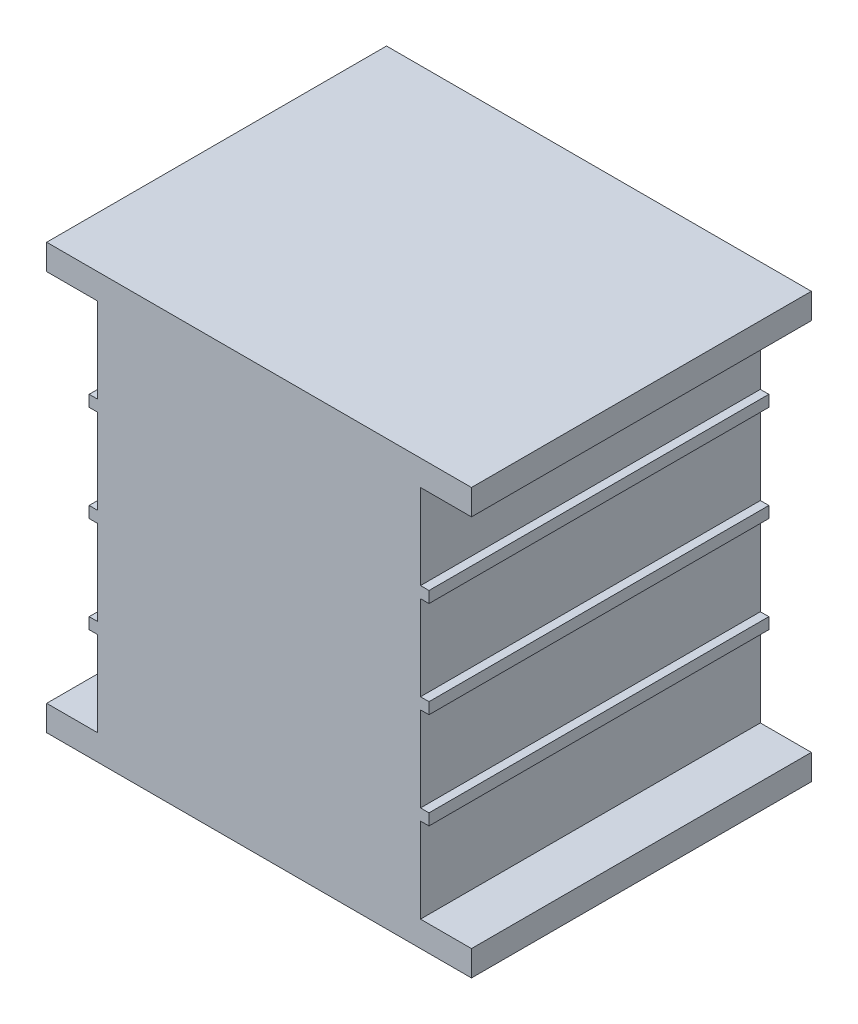
ISO-10303-21;
HEADER;
FILE_DESCRIPTION(('STEP AP214'),'2;1');
FILE_NAME('part.step','',(''),(''),'','','');
FILE_SCHEMA(('AUTOMOTIVE_DESIGN { 1 0 10303 214 1 1 1 1 }'));
ENDSEC;
DATA;
#1=APPLICATION_CONTEXT('core data for automotive mechanical design processes');
#2=APPLICATION_PROTOCOL_DEFINITION('international standard','automotive_design',2000,#1);
#3=PRODUCT_CONTEXT('',#1,'mechanical');
#4=PRODUCT('Part','Part','',(#3));
#5=PRODUCT_RELATED_PRODUCT_CATEGORY('part','',(#4));
#6=PRODUCT_DEFINITION_FORMATION('','',#4);
#7=PRODUCT_DEFINITION_CONTEXT('part definition',#1,'design');
#8=PRODUCT_DEFINITION('design','',#6,#7);
#9=PRODUCT_DEFINITION_SHAPE('','',#8);
#10=(LENGTH_UNIT() NAMED_UNIT(*) SI_UNIT(.MILLI.,.METRE.));
#11=(NAMED_UNIT(*) PLANE_ANGLE_UNIT() SI_UNIT($,.RADIAN.));
#12=(NAMED_UNIT(*) SI_UNIT($,.STERADIAN.) SOLID_ANGLE_UNIT());
#13=UNCERTAINTY_MEASURE_WITH_UNIT(LENGTH_MEASURE(1.E-05),#10,'distance_accuracy_value','');
#14=(GEOMETRIC_REPRESENTATION_CONTEXT(3) GLOBAL_UNCERTAINTY_ASSIGNED_CONTEXT((#13)) GLOBAL_UNIT_ASSIGNED_CONTEXT((#10,
#11,#12)) REPRESENTATION_CONTEXT('',''));
#15=CARTESIAN_POINT('',(0.,0.,0.));
#16=DIRECTION('',(0.,0.,1.));
#17=DIRECTION('',(1.,0.,0.));
#18=AXIS2_PLACEMENT_3D('',#15,#16,#17);
#19=CARTESIAN_POINT('',(0.,1.5,20.));
#20=DIRECTION('',(1.,0.,0.));
#21=DIRECTION('',(0.,0.,-1.));
#22=AXIS2_PLACEMENT_3D('',#19,#20,#21);
#23=PLANE('',#22);
#24=DIRECTION('',(0.,-1.,0.));
#25=VECTOR('',#24,1.);
#26=CARTESIAN_POINT('',(0.,1.5,0.));
#27=LINE('',#26,#25);
#28=CARTESIAN_POINT('',(0.,1.5,0.));
#29=VERTEX_POINT('',#28);
#30=CARTESIAN_POINT('',(0.,0.,0.));
#31=VERTEX_POINT('',#30);
#32=EDGE_CURVE('E314',#29,#31,#27,.T.);
#33=ORIENTED_EDGE('',*,*,#32,.T.);
#34=DIRECTION('',(0.,0.,-1.));
#35=VECTOR('',#34,1.);
#36=CARTESIAN_POINT('',(0.,0.,20.));
#37=LINE('',#36,#35);
#38=CARTESIAN_POINT('',(0.,0.,20.));
#39=VERTEX_POINT('',#38);
#40=EDGE_CURVE('E11',#39,#31,#37,.T.);
#41=ORIENTED_EDGE('',*,*,#40,.F.);
#42=DIRECTION('',(0.,-1.,0.));
#43=VECTOR('',#42,1.);
#44=CARTESIAN_POINT('',(0.,1.5,20.));
#45=LINE('',#44,#43);
#46=CARTESIAN_POINT('',(0.,1.5,20.));
#47=VERTEX_POINT('',#46);
#48=EDGE_CURVE('E420',#47,#39,#45,.T.);
#49=ORIENTED_EDGE('',*,*,#48,.F.);
#50=DIRECTION('',(0.,0.,-1.));
#51=VECTOR('',#50,1.);
#52=CARTESIAN_POINT('',(0.,1.5,20.));
#53=LINE('',#52,#51);
#54=EDGE_CURVE('E310',#47,#29,#53,.T.);
#55=ORIENTED_EDGE('',*,*,#54,.T.);
#56=EDGE_LOOP('',(#33,#41,#49,#55));
#57=FACE_BOUND('',#56,.T.);
#58=ADVANCED_FACE('F45',(#57),#23,.F.);
#59=CARTESIAN_POINT('',(0.,0.,20.));
#60=DIRECTION('',(0.,1.,0.));
#61=DIRECTION('',(0.,0.,1.));
#62=AXIS2_PLACEMENT_3D('',#59,#60,#61);
#63=PLANE('',#62);
#64=DIRECTION('',(1.,0.,0.));
#65=VECTOR('',#64,1.);
#66=CARTESIAN_POINT('',(0.,0.,0.));
#67=LINE('',#66,#65);
#68=CARTESIAN_POINT('',(25.,0.,0.));
#69=VERTEX_POINT('',#68);
#70=EDGE_CURVE('E318',#31,#69,#67,.T.);
#71=ORIENTED_EDGE('',*,*,#70,.T.);
#72=DIRECTION('',(0.,0.,-1.));
#73=VECTOR('',#72,1.);
#74=CARTESIAN_POINT('',(25.,0.,20.));
#75=LINE('',#74,#73);
#76=CARTESIAN_POINT('',(25.,0.,20.));
#77=VERTEX_POINT('',#76);
#78=EDGE_CURVE('E54',#77,#69,#75,.T.);
#79=ORIENTED_EDGE('',*,*,#78,.F.);
#80=DIRECTION('',(1.,0.,0.));
#81=VECTOR('',#80,1.);
#82=CARTESIAN_POINT('',(0.,0.,20.));
#83=LINE('',#82,#81);
#84=EDGE_CURVE('E189',#39,#77,#83,.T.);
#85=ORIENTED_EDGE('',*,*,#84,.F.);
#86=ORIENTED_EDGE('',*,*,#40,.T.);
#87=EDGE_LOOP('',(#71,#79,#85,#86));
#88=FACE_BOUND('',#87,.T.);
#89=ADVANCED_FACE('F682',(#88),#63,.F.);
#90=CARTESIAN_POINT('',(25.,0.,20.));
#91=DIRECTION('',(-1.,0.,0.));
#92=DIRECTION('',(0.,0.,1.));
#93=AXIS2_PLACEMENT_3D('',#90,#91,#92);
#94=PLANE('',#93);
#95=DIRECTION('',(0.,1.,0.));
#96=VECTOR('',#95,1.);
#97=CARTESIAN_POINT('',(25.,0.,0.));
#98=LINE('',#97,#96);
#99=CARTESIAN_POINT('',(25.,1.5,0.));
#100=VERTEX_POINT('',#99);
#101=EDGE_CURVE('E321',#69,#100,#98,.T.);
#102=ORIENTED_EDGE('',*,*,#101,.T.);
#103=DIRECTION('',(0.,0.,-1.));
#104=VECTOR('',#103,1.);
#105=CARTESIAN_POINT('',(25.,1.5,20.));
#106=LINE('',#105,#104);
#107=CARTESIAN_POINT('',(25.,1.5,20.));
#108=VERTEX_POINT('',#107);
#109=EDGE_CURVE('E543',#108,#100,#106,.T.);
#110=ORIENTED_EDGE('',*,*,#109,.F.);
#111=DIRECTION('',(0.,1.,0.));
#112=VECTOR('',#111,1.);
#113=CARTESIAN_POINT('',(25.,0.,20.));
#114=LINE('',#113,#112);
#115=EDGE_CURVE('E553',#77,#108,#114,.T.);
#116=ORIENTED_EDGE('',*,*,#115,.F.);
#117=ORIENTED_EDGE('',*,*,#78,.T.);
#118=EDGE_LOOP('',(#102,#110,#116,#117));
#119=FACE_BOUND('',#118,.T.);
#120=ADVANCED_FACE('F551',(#119),#94,.F.);
#121=CARTESIAN_POINT('',(25.,1.5,20.));
#122=DIRECTION('',(0.,-1.,0.));
#123=DIRECTION('',(1.,0.,0.));
#124=AXIS2_PLACEMENT_3D('',#121,#122,#123);
#125=PLANE('',#124);
#126=DIRECTION('',(-1.,0.,0.));
#127=VECTOR('',#126,1.);
#128=CARTESIAN_POINT('',(25.,1.5,0.));
#129=LINE('',#128,#127);
#130=CARTESIAN_POINT('',(22.,1.5,0.));
#131=VERTEX_POINT('',#130);
#132=EDGE_CURVE('E324',#100,#131,#129,.T.);
#133=ORIENTED_EDGE('',*,*,#132,.T.);
#134=DIRECTION('',(0.,0.,-1.));
#135=VECTOR('',#134,1.);
#136=CARTESIAN_POINT('',(22.,1.5,20.));
#137=LINE('',#136,#135);
#138=CARTESIAN_POINT('',(22.,1.5,20.));
#139=VERTEX_POINT('',#138);
#140=EDGE_CURVE('E539',#139,#131,#137,.T.);
#141=ORIENTED_EDGE('',*,*,#140,.F.);
#142=DIRECTION('',(-1.,0.,0.));
#143=VECTOR('',#142,1.);
#144=CARTESIAN_POINT('',(25.,1.5,20.));
#145=LINE('',#144,#143);
#146=EDGE_CURVE('E572',#108,#139,#145,.T.);
#147=ORIENTED_EDGE('',*,*,#146,.F.);
#148=ORIENTED_EDGE('',*,*,#109,.T.);
#149=EDGE_LOOP('',(#133,#141,#147,#148));
#150=FACE_BOUND('',#149,.T.);
#151=ADVANCED_FACE('F562',(#150),#125,.F.);
#152=CARTESIAN_POINT('',(22.,1.5,20.));
#153=DIRECTION('',(-1.,0.,0.));
#154=DIRECTION('',(0.,0.,1.));
#155=AXIS2_PLACEMENT_3D('',#152,#153,#154);
#156=PLANE('',#155);
#157=DIRECTION('',(0.,1.,0.));
#158=VECTOR('',#157,1.);
#159=CARTESIAN_POINT('',(22.,1.5,0.));
#160=LINE('',#159,#158);
#161=CARTESIAN_POINT('',(22.,6.5,0.));
#162=VERTEX_POINT('',#161);
#163=EDGE_CURVE('E327',#131,#162,#160,.T.);
#164=ORIENTED_EDGE('',*,*,#163,.T.);
#165=DIRECTION('',(0.,0.,-1.));
#166=VECTOR('',#165,1.);
#167=CARTESIAN_POINT('',(22.,6.5,20.));
#168=LINE('',#167,#166);
#169=CARTESIAN_POINT('',(22.,6.5,20.));
#170=VERTEX_POINT('',#169);
#171=EDGE_CURVE('E535',#170,#162,#168,.T.);
#172=ORIENTED_EDGE('',*,*,#171,.F.);
#173=DIRECTION('',(0.,1.,0.));
#174=VECTOR('',#173,1.);
#175=CARTESIAN_POINT('',(22.,1.5,20.));
#176=LINE('',#175,#174);
#177=EDGE_CURVE('E568',#139,#170,#176,.T.);
#178=ORIENTED_EDGE('',*,*,#177,.F.);
#179=ORIENTED_EDGE('',*,*,#140,.T.);
#180=EDGE_LOOP('',(#164,#172,#178,#179));
#181=FACE_BOUND('',#180,.T.);
#182=ADVANCED_FACE('F566',(#181),#156,.F.);
#183=CARTESIAN_POINT('',(22.,6.5,20.));
#184=DIRECTION('',(0.,1.,0.));
#185=DIRECTION('',(-1.,0.,0.));
#186=AXIS2_PLACEMENT_3D('',#183,#184,#185);
#187=PLANE('',#186);
#188=DIRECTION('',(1.,0.,0.));
#189=VECTOR('',#188,1.);
#190=CARTESIAN_POINT('',(22.,6.5,0.));
#191=LINE('',#190,#189);
#192=CARTESIAN_POINT('',(22.5,6.5,0.));
#193=VERTEX_POINT('',#192);
#194=EDGE_CURVE('E330',#162,#193,#191,.T.);
#195=ORIENTED_EDGE('',*,*,#194,.T.);
#196=DIRECTION('',(0.,0.,-1.));
#197=VECTOR('',#196,1.);
#198=CARTESIAN_POINT('',(22.5,6.5,20.));
#199=LINE('',#198,#197);
#200=CARTESIAN_POINT('',(22.5,6.5,20.));
#201=VERTEX_POINT('',#200);
#202=EDGE_CURVE('E531',#201,#193,#199,.T.);
#203=ORIENTED_EDGE('',*,*,#202,.F.);
#204=DIRECTION('',(1.,0.,0.));
#205=VECTOR('',#204,1.);
#206=CARTESIAN_POINT('',(22.,6.5,20.));
#207=LINE('',#206,#205);
#208=EDGE_CURVE('E571',#170,#201,#207,.T.);
#209=ORIENTED_EDGE('',*,*,#208,.F.);
#210=ORIENTED_EDGE('',*,*,#171,.T.);
#211=EDGE_LOOP('',(#195,#203,#209,#210));
#212=FACE_BOUND('',#211,.T.);
#213=ADVANCED_FACE('F695',(#212),#187,.F.);
#214=CARTESIAN_POINT('',(22.5,6.5,20.));
#215=DIRECTION('',(-1.,0.,0.));
#216=DIRECTION('',(0.,0.,1.));
#217=AXIS2_PLACEMENT_3D('',#214,#215,#216);
#218=PLANE('',#217);
#219=DIRECTION('',(0.,1.,0.));
#220=VECTOR('',#219,1.);
#221=CARTESIAN_POINT('',(22.5,6.5,0.));
#222=LINE('',#221,#220);
#223=CARTESIAN_POINT('',(22.5,7.16666666666667,0.));
#224=VERTEX_POINT('',#223);
#225=EDGE_CURVE('E333',#193,#224,#222,.T.);
#226=ORIENTED_EDGE('',*,*,#225,.T.);
#227=DIRECTION('',(0.,0.,-1.));
#228=VECTOR('',#227,1.);
#229=CARTESIAN_POINT('',(22.5,7.16666666666667,20.));
#230=LINE('',#229,#228);
#231=CARTESIAN_POINT('',(22.5,7.16666666666667,20.));
#232=VERTEX_POINT('',#231);
#233=EDGE_CURVE('E527',#232,#224,#230,.T.);
#234=ORIENTED_EDGE('',*,*,#233,.F.);
#235=DIRECTION('',(0.,1.,0.));
#236=VECTOR('',#235,1.);
#237=CARTESIAN_POINT('',(22.5,6.5,20.));
#238=LINE('',#237,#236);
#239=EDGE_CURVE('E576',#201,#232,#238,.T.);
#240=ORIENTED_EDGE('',*,*,#239,.F.);
#241=ORIENTED_EDGE('',*,*,#202,.T.);
#242=EDGE_LOOP('',(#226,#234,#240,#241));
#243=FACE_BOUND('',#242,.T.);
#244=ADVANCED_FACE('F698',(#243),#218,.F.);
#245=CARTESIAN_POINT('',(22.5,7.16666666666667,20.));
#246=DIRECTION('',(0.,-1.,0.));
#247=DIRECTION('',(0.,0.,-1.));
#248=AXIS2_PLACEMENT_3D('',#245,#246,#247);
#249=PLANE('',#248);
#250=DIRECTION('',(-1.,0.,0.));
#251=VECTOR('',#250,1.);
#252=CARTESIAN_POINT('',(22.5,7.16666666666667,0.));
#253=LINE('',#252,#251);
#254=CARTESIAN_POINT('',(22.,7.16666666666667,0.));
#255=VERTEX_POINT('',#254);
#256=EDGE_CURVE('E336',#224,#255,#253,.T.);
#257=ORIENTED_EDGE('',*,*,#256,.T.);
#258=DIRECTION('',(0.,0.,-1.));
#259=VECTOR('',#258,1.);
#260=CARTESIAN_POINT('',(22.,7.16666666666667,20.));
#261=LINE('',#260,#259);
#262=CARTESIAN_POINT('',(22.,7.16666666666667,20.));
#263=VERTEX_POINT('',#262);
#264=EDGE_CURVE('E523',#263,#255,#261,.T.);
#265=ORIENTED_EDGE('',*,*,#264,.F.);
#266=DIRECTION('',(-1.,0.,0.));
#267=VECTOR('',#266,1.);
#268=CARTESIAN_POINT('',(22.5,7.16666666666667,20.));
#269=LINE('',#268,#267);
#270=EDGE_CURVE('E583',#232,#263,#269,.T.);
#271=ORIENTED_EDGE('',*,*,#270,.F.);
#272=ORIENTED_EDGE('',*,*,#233,.T.);
#273=EDGE_LOOP('',(#257,#265,#271,#272));
#274=FACE_BOUND('',#273,.T.);
#275=ADVANCED_FACE('F702',(#274),#249,.F.);
#276=CARTESIAN_POINT('',(22.,7.16666666666667,20.));
#277=DIRECTION('',(-1.,0.,0.));
#278=DIRECTION('',(0.,0.,1.));
#279=AXIS2_PLACEMENT_3D('',#276,#277,#278);
#280=PLANE('',#279);
#281=DIRECTION('',(0.,1.,0.));
#282=VECTOR('',#281,1.);
#283=CARTESIAN_POINT('',(22.,7.16666666666667,0.));
#284=LINE('',#283,#282);
#285=CARTESIAN_POINT('',(22.,12.1666666666667,0.));
#286=VERTEX_POINT('',#285);
#287=EDGE_CURVE('E339',#255,#286,#284,.T.);
#288=ORIENTED_EDGE('',*,*,#287,.T.);
#289=DIRECTION('',(0.,0.,-1.));
#290=VECTOR('',#289,1.);
#291=CARTESIAN_POINT('',(22.,12.1666666666667,20.));
#292=LINE('',#291,#290);
#293=CARTESIAN_POINT('',(22.,12.1666666666667,20.));
#294=VERTEX_POINT('',#293);
#295=EDGE_CURVE('E519',#294,#286,#292,.T.);
#296=ORIENTED_EDGE('',*,*,#295,.F.);
#297=DIRECTION('',(0.,1.,0.));
#298=VECTOR('',#297,1.);
#299=CARTESIAN_POINT('',(22.,7.16666666666667,20.));
#300=LINE('',#299,#298);
#301=EDGE_CURVE('E586',#263,#294,#300,.T.);
#302=ORIENTED_EDGE('',*,*,#301,.F.);
#303=ORIENTED_EDGE('',*,*,#264,.T.);
#304=EDGE_LOOP('',(#288,#296,#302,#303));
#305=FACE_BOUND('',#304,.T.);
#306=ADVANCED_FACE('F706',(#305),#280,.F.);
#307=CARTESIAN_POINT('',(22.,12.1666666666667,20.));
#308=DIRECTION('',(0.,1.,0.));
#309=DIRECTION('',(0.,0.,1.));
#310=AXIS2_PLACEMENT_3D('',#307,#308,#309);
#311=PLANE('',#310);
#312=DIRECTION('',(1.,0.,0.));
#313=VECTOR('',#312,1.);
#314=CARTESIAN_POINT('',(22.,12.1666666666667,0.));
#315=LINE('',#314,#313);
#316=CARTESIAN_POINT('',(22.5,12.1666666666667,0.));
#317=VERTEX_POINT('',#316);
#318=EDGE_CURVE('E342',#286,#317,#315,.T.);
#319=ORIENTED_EDGE('',*,*,#318,.T.);
#320=DIRECTION('',(0.,0.,-1.));
#321=VECTOR('',#320,1.);
#322=CARTESIAN_POINT('',(22.5,12.1666666666667,20.));
#323=LINE('',#322,#321);
#324=CARTESIAN_POINT('',(22.5,12.1666666666667,20.));
#325=VERTEX_POINT('',#324);
#326=EDGE_CURVE('E515',#325,#317,#323,.T.);
#327=ORIENTED_EDGE('',*,*,#326,.F.);
#328=DIRECTION('',(1.,0.,0.));
#329=VECTOR('',#328,1.);
#330=CARTESIAN_POINT('',(22.,12.1666666666667,20.));
#331=LINE('',#330,#329);
#332=EDGE_CURVE('E589',#294,#325,#331,.T.);
#333=ORIENTED_EDGE('',*,*,#332,.F.);
#334=ORIENTED_EDGE('',*,*,#295,.T.);
#335=EDGE_LOOP('',(#319,#327,#333,#334));
#336=FACE_BOUND('',#335,.T.);
#337=ADVANCED_FACE('F710',(#336),#311,.F.);
#338=CARTESIAN_POINT('',(22.5,12.1666666666667,20.));
#339=DIRECTION('',(-1.,0.,0.));
#340=DIRECTION('',(0.,0.,1.));
#341=AXIS2_PLACEMENT_3D('',#338,#339,#340);
#342=PLANE('',#341);
#343=DIRECTION('',(0.,1.,0.));
#344=VECTOR('',#343,1.);
#345=CARTESIAN_POINT('',(22.5,12.1666666666667,0.));
#346=LINE('',#345,#344);
#347=CARTESIAN_POINT('',(22.5,12.8333333333333,0.));
#348=VERTEX_POINT('',#347);
#349=EDGE_CURVE('E345',#317,#348,#346,.T.);
#350=ORIENTED_EDGE('',*,*,#349,.T.);
#351=DIRECTION('',(0.,0.,-1.));
#352=VECTOR('',#351,1.);
#353=CARTESIAN_POINT('',(22.5,12.8333333333333,20.));
#354=LINE('',#353,#352);
#355=CARTESIAN_POINT('',(22.5,12.8333333333333,20.));
#356=VERTEX_POINT('',#355);
#357=EDGE_CURVE('E511',#356,#348,#354,.T.);
#358=ORIENTED_EDGE('',*,*,#357,.F.);
#359=DIRECTION('',(0.,1.,0.));
#360=VECTOR('',#359,1.);
#361=CARTESIAN_POINT('',(22.5,12.1666666666667,20.));
#362=LINE('',#361,#360);
#363=EDGE_CURVE('E592',#325,#356,#362,.T.);
#364=ORIENTED_EDGE('',*,*,#363,.F.);
#365=ORIENTED_EDGE('',*,*,#326,.T.);
#366=EDGE_LOOP('',(#350,#358,#364,#365));
#367=FACE_BOUND('',#366,.T.);
#368=ADVANCED_FACE('F714',(#367),#342,.F.);
#369=CARTESIAN_POINT('',(22.5,12.8333333333333,20.));
#370=DIRECTION('',(0.,-1.,0.));
#371=DIRECTION('',(0.,0.,-1.));
#372=AXIS2_PLACEMENT_3D('',#369,#370,#371);
#373=PLANE('',#372);
#374=DIRECTION('',(-1.,0.,0.));
#375=VECTOR('',#374,1.);
#376=CARTESIAN_POINT('',(22.5,12.8333333333333,0.));
#377=LINE('',#376,#375);
#378=CARTESIAN_POINT('',(22.,12.8333333333333,0.));
#379=VERTEX_POINT('',#378);
#380=EDGE_CURVE('E348',#348,#379,#377,.T.);
#381=ORIENTED_EDGE('',*,*,#380,.T.);
#382=DIRECTION('',(0.,0.,-1.));
#383=VECTOR('',#382,1.);
#384=CARTESIAN_POINT('',(22.,12.8333333333333,20.));
#385=LINE('',#384,#383);
#386=CARTESIAN_POINT('',(22.,12.8333333333333,20.));
#387=VERTEX_POINT('',#386);
#388=EDGE_CURVE('E507',#387,#379,#385,.T.);
#389=ORIENTED_EDGE('',*,*,#388,.F.);
#390=DIRECTION('',(-1.,0.,0.));
#391=VECTOR('',#390,1.);
#392=CARTESIAN_POINT('',(22.5,12.8333333333333,20.));
#393=LINE('',#392,#391);
#394=EDGE_CURVE('E595',#356,#387,#393,.T.);
#395=ORIENTED_EDGE('',*,*,#394,.F.);
#396=ORIENTED_EDGE('',*,*,#357,.T.);
#397=EDGE_LOOP('',(#381,#389,#395,#396));
#398=FACE_BOUND('',#397,.T.);
#399=ADVANCED_FACE('F718',(#398),#373,.F.);
#400=CARTESIAN_POINT('',(22.,12.8333333333333,20.));
#401=DIRECTION('',(-1.,0.,0.));
#402=DIRECTION('',(0.,0.,1.));
#403=AXIS2_PLACEMENT_3D('',#400,#401,#402);
#404=PLANE('',#403);
#405=DIRECTION('',(0.,1.,0.));
#406=VECTOR('',#405,1.);
#407=CARTESIAN_POINT('',(22.,12.8333333333333,0.));
#408=LINE('',#407,#406);
#409=CARTESIAN_POINT('',(22.,17.8333333333333,0.));
#410=VERTEX_POINT('',#409);
#411=EDGE_CURVE('E351',#379,#410,#408,.T.);
#412=ORIENTED_EDGE('',*,*,#411,.T.);
#413=DIRECTION('',(0.,0.,-1.));
#414=VECTOR('',#413,1.);
#415=CARTESIAN_POINT('',(22.,17.8333333333333,20.));
#416=LINE('',#415,#414);
#417=CARTESIAN_POINT('',(22.,17.8333333333333,20.));
#418=VERTEX_POINT('',#417);
#419=EDGE_CURVE('E503',#418,#410,#416,.T.);
#420=ORIENTED_EDGE('',*,*,#419,.F.);
#421=DIRECTION('',(0.,1.,0.));
#422=VECTOR('',#421,1.);
#423=CARTESIAN_POINT('',(22.,12.8333333333333,20.));
#424=LINE('',#423,#422);
#425=EDGE_CURVE('E598',#387,#418,#424,.T.);
#426=ORIENTED_EDGE('',*,*,#425,.F.);
#427=ORIENTED_EDGE('',*,*,#388,.T.);
#428=EDGE_LOOP('',(#412,#420,#426,#427));
#429=FACE_BOUND('',#428,.T.);
#430=ADVANCED_FACE('F722',(#429),#404,.F.);
#431=CARTESIAN_POINT('',(22.,17.8333333333333,20.));
#432=DIRECTION('',(0.,1.,0.));
#433=DIRECTION('',(0.,0.,1.));
#434=AXIS2_PLACEMENT_3D('',#431,#432,#433);
#435=PLANE('',#434);
#436=DIRECTION('',(1.,0.,0.));
#437=VECTOR('',#436,1.);
#438=CARTESIAN_POINT('',(22.,17.8333333333333,0.));
#439=LINE('',#438,#437);
#440=CARTESIAN_POINT('',(22.5,17.8333333333333,0.));
#441=VERTEX_POINT('',#440);
#442=EDGE_CURVE('E354',#410,#441,#439,.T.);
#443=ORIENTED_EDGE('',*,*,#442,.T.);
#444=DIRECTION('',(0.,0.,-1.));
#445=VECTOR('',#444,1.);
#446=CARTESIAN_POINT('',(22.5,17.8333333333333,20.));
#447=LINE('',#446,#445);
#448=CARTESIAN_POINT('',(22.5,17.8333333333333,20.));
#449=VERTEX_POINT('',#448);
#450=EDGE_CURVE('E499',#449,#441,#447,.T.);
#451=ORIENTED_EDGE('',*,*,#450,.F.);
#452=DIRECTION('',(1.,0.,0.));
#453=VECTOR('',#452,1.);
#454=CARTESIAN_POINT('',(22.,17.8333333333333,20.));
#455=LINE('',#454,#453);
#456=EDGE_CURVE('E601',#418,#449,#455,.T.);
#457=ORIENTED_EDGE('',*,*,#456,.F.);
#458=ORIENTED_EDGE('',*,*,#419,.T.);
#459=EDGE_LOOP('',(#443,#451,#457,#458));
#460=FACE_BOUND('',#459,.T.);
#461=ADVANCED_FACE('F726',(#460),#435,.F.);
#462=CARTESIAN_POINT('',(22.5,17.8333333333333,20.));
#463=DIRECTION('',(-1.,0.,0.));
#464=DIRECTION('',(0.,0.,1.));
#465=AXIS2_PLACEMENT_3D('',#462,#463,#464);
#466=PLANE('',#465);
#467=DIRECTION('',(0.,1.,0.));
#468=VECTOR('',#467,1.);
#469=CARTESIAN_POINT('',(22.5,17.8333333333333,0.));
#470=LINE('',#469,#468);
#471=CARTESIAN_POINT('',(22.5,18.5,0.));
#472=VERTEX_POINT('',#471);
#473=EDGE_CURVE('E357',#441,#472,#470,.T.);
#474=ORIENTED_EDGE('',*,*,#473,.T.);
#475=DIRECTION('',(0.,0.,-1.));
#476=VECTOR('',#475,1.);
#477=CARTESIAN_POINT('',(22.5,18.5,20.));
#478=LINE('',#477,#476);
#479=CARTESIAN_POINT('',(22.5,18.5,20.));
#480=VERTEX_POINT('',#479);
#481=EDGE_CURVE('E495',#480,#472,#478,.T.);
#482=ORIENTED_EDGE('',*,*,#481,.F.);
#483=DIRECTION('',(0.,1.,0.));
#484=VECTOR('',#483,1.);
#485=CARTESIAN_POINT('',(22.5,17.8333333333333,20.));
#486=LINE('',#485,#484);
#487=EDGE_CURVE('E604',#449,#480,#486,.T.);
#488=ORIENTED_EDGE('',*,*,#487,.F.);
#489=ORIENTED_EDGE('',*,*,#450,.T.);
#490=EDGE_LOOP('',(#474,#482,#488,#489));
#491=FACE_BOUND('',#490,.T.);
#492=ADVANCED_FACE('F730',(#491),#466,.F.);
#493=CARTESIAN_POINT('',(22.5,18.5,20.));
#494=DIRECTION('',(0.,-1.,0.));
#495=DIRECTION('',(0.,0.,-1.));
#496=AXIS2_PLACEMENT_3D('',#493,#494,#495);
#497=PLANE('',#496);
#498=DIRECTION('',(-1.,0.,0.));
#499=VECTOR('',#498,1.);
#500=CARTESIAN_POINT('',(22.5,18.5,0.));
#501=LINE('',#500,#499);
#502=CARTESIAN_POINT('',(22.,18.5,0.));
#503=VERTEX_POINT('',#502);
#504=EDGE_CURVE('E360',#472,#503,#501,.T.);
#505=ORIENTED_EDGE('',*,*,#504,.T.);
#506=DIRECTION('',(0.,0.,-1.));
#507=VECTOR('',#506,1.);
#508=CARTESIAN_POINT('',(22.,18.5,20.));
#509=LINE('',#508,#507);
#510=CARTESIAN_POINT('',(22.,18.5,20.));
#511=VERTEX_POINT('',#510);
#512=EDGE_CURVE('E491',#511,#503,#509,.T.);
#513=ORIENTED_EDGE('',*,*,#512,.F.);
#514=DIRECTION('',(-1.,0.,0.));
#515=VECTOR('',#514,1.);
#516=CARTESIAN_POINT('',(22.5,18.5,20.));
#517=LINE('',#516,#515);
#518=EDGE_CURVE('E607',#480,#511,#517,.T.);
#519=ORIENTED_EDGE('',*,*,#518,.F.);
#520=ORIENTED_EDGE('',*,*,#481,.T.);
#521=EDGE_LOOP('',(#505,#513,#519,#520));
#522=FACE_BOUND('',#521,.T.);
#523=ADVANCED_FACE('F734',(#522),#497,.F.);
#524=CARTESIAN_POINT('',(22.,18.5,20.));
#525=DIRECTION('',(-1.,0.,0.));
#526=DIRECTION('',(0.,-1.,0.));
#527=AXIS2_PLACEMENT_3D('',#524,#525,#526);
#528=PLANE('',#527);
#529=DIRECTION('',(0.,1.,0.));
#530=VECTOR('',#529,1.);
#531=CARTESIAN_POINT('',(22.,18.5,0.));
#532=LINE('',#531,#530);
#533=CARTESIAN_POINT('',(22.,23.5,0.));
#534=VERTEX_POINT('',#533);
#535=EDGE_CURVE('E363',#503,#534,#532,.T.);
#536=ORIENTED_EDGE('',*,*,#535,.T.);
#537=DIRECTION('',(0.,0.,-1.));
#538=VECTOR('',#537,1.);
#539=CARTESIAN_POINT('',(22.,23.5,20.));
#540=LINE('',#539,#538);
#541=CARTESIAN_POINT('',(22.,23.5,20.));
#542=VERTEX_POINT('',#541);
#543=EDGE_CURVE('E487',#542,#534,#540,.T.);
#544=ORIENTED_EDGE('',*,*,#543,.F.);
#545=DIRECTION('',(0.,1.,0.));
#546=VECTOR('',#545,1.);
#547=CARTESIAN_POINT('',(22.,18.5,20.));
#548=LINE('',#547,#546);
#549=EDGE_CURVE('E610',#511,#542,#548,.T.);
#550=ORIENTED_EDGE('',*,*,#549,.F.);
#551=ORIENTED_EDGE('',*,*,#512,.T.);
#552=EDGE_LOOP('',(#536,#544,#550,#551));
#553=FACE_BOUND('',#552,.T.);
#554=ADVANCED_FACE('F738',(#553),#528,.F.);
#555=CARTESIAN_POINT('',(22.,23.5,20.));
#556=DIRECTION('',(0.,1.,0.));
#557=DIRECTION('',(0.,0.,1.));
#558=AXIS2_PLACEMENT_3D('',#555,#556,#557);
#559=PLANE('',#558);
#560=DIRECTION('',(1.,0.,0.));
#561=VECTOR('',#560,1.);
#562=CARTESIAN_POINT('',(22.,23.5,0.));
#563=LINE('',#562,#561);
#564=CARTESIAN_POINT('',(25.,23.5,0.));
#565=VERTEX_POINT('',#564);
#566=EDGE_CURVE('E366',#534,#565,#563,.T.);
#567=ORIENTED_EDGE('',*,*,#566,.T.);
#568=DIRECTION('',(0.,0.,-1.));
#569=VECTOR('',#568,1.);
#570=CARTESIAN_POINT('',(25.,23.5,20.));
#571=LINE('',#570,#569);
#572=CARTESIAN_POINT('',(25.,23.5,20.));
#573=VERTEX_POINT('',#572);
#574=EDGE_CURVE('E483',#573,#565,#571,.T.);
#575=ORIENTED_EDGE('',*,*,#574,.F.);
#576=DIRECTION('',(1.,0.,0.));
#577=VECTOR('',#576,1.);
#578=CARTESIAN_POINT('',(22.,23.5,20.));
#579=LINE('',#578,#577);
#580=EDGE_CURVE('E613',#542,#573,#579,.T.);
#581=ORIENTED_EDGE('',*,*,#580,.F.);
#582=ORIENTED_EDGE('',*,*,#543,.T.);
#583=EDGE_LOOP('',(#567,#575,#581,#582));
#584=FACE_BOUND('',#583,.T.);
#585=ADVANCED_FACE('F742',(#584),#559,.F.);
#586=CARTESIAN_POINT('',(25.,23.5,20.));
#587=DIRECTION('',(-1.,0.,0.));
#588=DIRECTION('',(0.,0.,1.));
#589=AXIS2_PLACEMENT_3D('',#586,#587,#588);
#590=PLANE('',#589);
#591=DIRECTION('',(0.,1.,0.));
#592=VECTOR('',#591,1.);
#593=CARTESIAN_POINT('',(25.,23.5,0.));
#594=LINE('',#593,#592);
#595=CARTESIAN_POINT('',(25.,25.,0.));
#596=VERTEX_POINT('',#595);
#597=EDGE_CURVE('E369',#565,#596,#594,.T.);
#598=ORIENTED_EDGE('',*,*,#597,.T.);
#599=DIRECTION('',(0.,0.,-1.));
#600=VECTOR('',#599,1.);
#601=CARTESIAN_POINT('',(25.,25.,20.));
#602=LINE('',#601,#600);
#603=CARTESIAN_POINT('',(25.,25.,20.));
#604=VERTEX_POINT('',#603);
#605=EDGE_CURVE('E479',#604,#596,#602,.T.);
#606=ORIENTED_EDGE('',*,*,#605,.F.);
#607=DIRECTION('',(0.,1.,0.));
#608=VECTOR('',#607,1.);
#609=CARTESIAN_POINT('',(25.,23.5,20.));
#610=LINE('',#609,#608);
#611=EDGE_CURVE('E616',#573,#604,#610,.T.);
#612=ORIENTED_EDGE('',*,*,#611,.F.);
#613=ORIENTED_EDGE('',*,*,#574,.T.);
#614=EDGE_LOOP('',(#598,#606,#612,#613));
#615=FACE_BOUND('',#614,.T.);
#616=ADVANCED_FACE('F746',(#615),#590,.F.);
#617=CARTESIAN_POINT('',(25.,25.,20.));
#618=DIRECTION('',(0.,-1.,0.));
#619=DIRECTION('',(1.,0.,0.));
#620=AXIS2_PLACEMENT_3D('',#617,#618,#619);
#621=PLANE('',#620);
#622=DIRECTION('',(-1.,0.,0.));
#623=VECTOR('',#622,1.);
#624=CARTESIAN_POINT('',(25.,25.,0.));
#625=LINE('',#624,#623);
#626=CARTESIAN_POINT('',(0.,25.,0.));
#627=VERTEX_POINT('',#626);
#628=EDGE_CURVE('E372',#596,#627,#625,.T.);
#629=ORIENTED_EDGE('',*,*,#628,.T.);
#630=DIRECTION('',(0.,0.,-1.));
#631=VECTOR('',#630,1.);
#632=CARTESIAN_POINT('',(0.,25.,20.));
#633=LINE('',#632,#631);
#634=CARTESIAN_POINT('',(0.,25.,20.));
#635=VERTEX_POINT('',#634);
#636=EDGE_CURVE('E475',#635,#627,#633,.T.);
#637=ORIENTED_EDGE('',*,*,#636,.F.);
#638=DIRECTION('',(-1.,0.,0.));
#639=VECTOR('',#638,1.);
#640=CARTESIAN_POINT('',(25.,25.,20.));
#641=LINE('',#640,#639);
#642=EDGE_CURVE('E619',#604,#635,#641,.T.);
#643=ORIENTED_EDGE('',*,*,#642,.F.);
#644=ORIENTED_EDGE('',*,*,#605,.T.);
#645=EDGE_LOOP('',(#629,#637,#643,#644));
#646=FACE_BOUND('',#645,.T.);
#647=ADVANCED_FACE('F750',(#646),#621,.F.);
#648=CARTESIAN_POINT('',(0.,25.,20.));
#649=DIRECTION('',(1.,0.,0.));
#650=DIRECTION('',(0.,0.,-1.));
#651=AXIS2_PLACEMENT_3D('',#648,#649,#650);
#652=PLANE('',#651);
#653=DIRECTION('',(0.,-1.,0.));
#654=VECTOR('',#653,1.);
#655=CARTESIAN_POINT('',(0.,25.,0.));
#656=LINE('',#655,#654);
#657=CARTESIAN_POINT('',(0.,23.5,0.));
#658=VERTEX_POINT('',#657);
#659=EDGE_CURVE('E375',#627,#658,#656,.T.);
#660=ORIENTED_EDGE('',*,*,#659,.T.);
#661=DIRECTION('',(0.,0.,-1.));
#662=VECTOR('',#661,1.);
#663=CARTESIAN_POINT('',(0.,23.5,20.));
#664=LINE('',#663,#662);
#665=CARTESIAN_POINT('',(0.,23.5,20.));
#666=VERTEX_POINT('',#665);
#667=EDGE_CURVE('E471',#666,#658,#664,.T.);
#668=ORIENTED_EDGE('',*,*,#667,.F.);
#669=DIRECTION('',(0.,-1.,0.));
#670=VECTOR('',#669,1.);
#671=CARTESIAN_POINT('',(0.,25.,20.));
#672=LINE('',#671,#670);
#673=EDGE_CURVE('E622',#635,#666,#672,.T.);
#674=ORIENTED_EDGE('',*,*,#673,.F.);
#675=ORIENTED_EDGE('',*,*,#636,.T.);
#676=EDGE_LOOP('',(#660,#668,#674,#675));
#677=FACE_BOUND('',#676,.T.);
#678=ADVANCED_FACE('F754',(#677),#652,.F.);
#679=CARTESIAN_POINT('',(0.,23.5,20.));
#680=DIRECTION('',(0.,1.,0.));
#681=DIRECTION('',(0.,0.,1.));
#682=AXIS2_PLACEMENT_3D('',#679,#680,#681);
#683=PLANE('',#682);
#684=DIRECTION('',(1.,0.,0.));
#685=VECTOR('',#684,1.);
#686=CARTESIAN_POINT('',(0.,23.5,0.));
#687=LINE('',#686,#685);
#688=CARTESIAN_POINT('',(3.,23.5,0.));
#689=VERTEX_POINT('',#688);
#690=EDGE_CURVE('E378',#658,#689,#687,.T.);
#691=ORIENTED_EDGE('',*,*,#690,.T.);
#692=DIRECTION('',(0.,0.,-1.));
#693=VECTOR('',#692,1.);
#694=CARTESIAN_POINT('',(3.,23.5,20.));
#695=LINE('',#694,#693);
#696=CARTESIAN_POINT('',(3.,23.5,20.));
#697=VERTEX_POINT('',#696);
#698=EDGE_CURVE('E467',#697,#689,#695,.T.);
#699=ORIENTED_EDGE('',*,*,#698,.F.);
#700=DIRECTION('',(1.,0.,0.));
#701=VECTOR('',#700,1.);
#702=CARTESIAN_POINT('',(0.,23.5,20.));
#703=LINE('',#702,#701);
#704=EDGE_CURVE('E625',#666,#697,#703,.T.);
#705=ORIENTED_EDGE('',*,*,#704,.F.);
#706=ORIENTED_EDGE('',*,*,#667,.T.);
#707=EDGE_LOOP('',(#691,#699,#705,#706));
#708=FACE_BOUND('',#707,.T.);
#709=ADVANCED_FACE('F758',(#708),#683,.F.);
#710=CARTESIAN_POINT('',(3.,23.5,20.));
#711=DIRECTION('',(1.,0.,0.));
#712=DIRECTION('',(0.,0.,-1.));
#713=AXIS2_PLACEMENT_3D('',#710,#711,#712);
#714=PLANE('',#713);
#715=DIRECTION('',(0.,-1.,0.));
#716=VECTOR('',#715,1.);
#717=CARTESIAN_POINT('',(3.,23.5,0.));
#718=LINE('',#717,#716);
#719=CARTESIAN_POINT('',(3.,18.5,0.));
#720=VERTEX_POINT('',#719);
#721=EDGE_CURVE('E381',#689,#720,#718,.T.);
#722=ORIENTED_EDGE('',*,*,#721,.T.);
#723=DIRECTION('',(0.,0.,-1.));
#724=VECTOR('',#723,1.);
#725=CARTESIAN_POINT('',(3.,18.5,20.));
#726=LINE('',#725,#724);
#727=CARTESIAN_POINT('',(3.,18.5,20.));
#728=VERTEX_POINT('',#727);
#729=EDGE_CURVE('E463',#728,#720,#726,.T.);
#730=ORIENTED_EDGE('',*,*,#729,.F.);
#731=DIRECTION('',(0.,-1.,0.));
#732=VECTOR('',#731,1.);
#733=CARTESIAN_POINT('',(3.,23.5,20.));
#734=LINE('',#733,#732);
#735=EDGE_CURVE('E628',#697,#728,#734,.T.);
#736=ORIENTED_EDGE('',*,*,#735,.F.);
#737=ORIENTED_EDGE('',*,*,#698,.T.);
#738=EDGE_LOOP('',(#722,#730,#736,#737));
#739=FACE_BOUND('',#738,.T.);
#740=ADVANCED_FACE('F762',(#739),#714,.F.);
#741=CARTESIAN_POINT('',(3.,18.5,20.));
#742=DIRECTION('',(0.,-1.,0.));
#743=DIRECTION('',(0.,0.,-1.));
#744=AXIS2_PLACEMENT_3D('',#741,#742,#743);
#745=PLANE('',#744);
#746=DIRECTION('',(-1.,0.,0.));
#747=VECTOR('',#746,1.);
#748=CARTESIAN_POINT('',(3.,18.5,0.));
#749=LINE('',#748,#747);
#750=CARTESIAN_POINT('',(2.5,18.5,0.));
#751=VERTEX_POINT('',#750);
#752=EDGE_CURVE('E384',#720,#751,#749,.T.);
#753=ORIENTED_EDGE('',*,*,#752,.T.);
#754=DIRECTION('',(0.,0.,-1.));
#755=VECTOR('',#754,1.);
#756=CARTESIAN_POINT('',(2.5,18.5,20.));
#757=LINE('',#756,#755);
#758=CARTESIAN_POINT('',(2.5,18.5,20.));
#759=VERTEX_POINT('',#758);
#760=EDGE_CURVE('E459',#759,#751,#757,.T.);
#761=ORIENTED_EDGE('',*,*,#760,.F.);
#762=DIRECTION('',(-1.,0.,0.));
#763=VECTOR('',#762,1.);
#764=CARTESIAN_POINT('',(3.,18.5,20.));
#765=LINE('',#764,#763);
#766=EDGE_CURVE('E631',#728,#759,#765,.T.);
#767=ORIENTED_EDGE('',*,*,#766,.F.);
#768=ORIENTED_EDGE('',*,*,#729,.T.);
#769=EDGE_LOOP('',(#753,#761,#767,#768));
#770=FACE_BOUND('',#769,.T.);
#771=ADVANCED_FACE('F766',(#770),#745,.F.);
#772=CARTESIAN_POINT('',(2.5,18.5,20.));
#773=DIRECTION('',(1.,0.,0.));
#774=DIRECTION('',(0.,1.,0.));
#775=AXIS2_PLACEMENT_3D('',#772,#773,#774);
#776=PLANE('',#775);
#777=DIRECTION('',(0.,-1.,0.));
#778=VECTOR('',#777,1.);
#779=CARTESIAN_POINT('',(2.5,18.5,0.));
#780=LINE('',#779,#778);
#781=CARTESIAN_POINT('',(2.5,17.8333333333333,0.));
#782=VERTEX_POINT('',#781);
#783=EDGE_CURVE('E387',#751,#782,#780,.T.);
#784=ORIENTED_EDGE('',*,*,#783,.T.);
#785=DIRECTION('',(0.,0.,-1.));
#786=VECTOR('',#785,1.);
#787=CARTESIAN_POINT('',(2.5,17.8333333333333,20.));
#788=LINE('',#787,#786);
#789=CARTESIAN_POINT('',(2.5,17.8333333333333,20.));
#790=VERTEX_POINT('',#789);
#791=EDGE_CURVE('E455',#790,#782,#788,.T.);
#792=ORIENTED_EDGE('',*,*,#791,.F.);
#793=DIRECTION('',(0.,-1.,0.));
#794=VECTOR('',#793,1.);
#795=CARTESIAN_POINT('',(2.5,18.5,20.));
#796=LINE('',#795,#794);
#797=EDGE_CURVE('E634',#759,#790,#796,.T.);
#798=ORIENTED_EDGE('',*,*,#797,.F.);
#799=ORIENTED_EDGE('',*,*,#760,.T.);
#800=EDGE_LOOP('',(#784,#792,#798,#799));
#801=FACE_BOUND('',#800,.T.);
#802=ADVANCED_FACE('F770',(#801),#776,.F.);
#803=CARTESIAN_POINT('',(2.5,17.8333333333333,20.));
#804=DIRECTION('',(0.,1.,0.));
#805=DIRECTION('',(0.,0.,1.));
#806=AXIS2_PLACEMENT_3D('',#803,#804,#805);
#807=PLANE('',#806);
#808=DIRECTION('',(1.,0.,0.));
#809=VECTOR('',#808,1.);
#810=CARTESIAN_POINT('',(2.5,17.8333333333333,0.));
#811=LINE('',#810,#809);
#812=CARTESIAN_POINT('',(3.,17.8333333333333,0.));
#813=VERTEX_POINT('',#812);
#814=EDGE_CURVE('E390',#782,#813,#811,.T.);
#815=ORIENTED_EDGE('',*,*,#814,.T.);
#816=DIRECTION('',(0.,0.,-1.));
#817=VECTOR('',#816,1.);
#818=CARTESIAN_POINT('',(3.,17.8333333333333,20.));
#819=LINE('',#818,#817);
#820=CARTESIAN_POINT('',(3.,17.8333333333333,20.));
#821=VERTEX_POINT('',#820);
#822=EDGE_CURVE('E451',#821,#813,#819,.T.);
#823=ORIENTED_EDGE('',*,*,#822,.F.);
#824=DIRECTION('',(1.,0.,0.));
#825=VECTOR('',#824,1.);
#826=CARTESIAN_POINT('',(2.5,17.8333333333333,20.));
#827=LINE('',#826,#825);
#828=EDGE_CURVE('E637',#790,#821,#827,.T.);
#829=ORIENTED_EDGE('',*,*,#828,.F.);
#830=ORIENTED_EDGE('',*,*,#791,.T.);
#831=EDGE_LOOP('',(#815,#823,#829,#830));
#832=FACE_BOUND('',#831,.T.);
#833=ADVANCED_FACE('F774',(#832),#807,.F.);
#834=CARTESIAN_POINT('',(3.,17.8333333333333,20.));
#835=DIRECTION('',(1.,0.,0.));
#836=DIRECTION('',(0.,1.,0.));
#837=AXIS2_PLACEMENT_3D('',#834,#835,#836);
#838=PLANE('',#837);
#839=DIRECTION('',(0.,-1.,0.));
#840=VECTOR('',#839,1.);
#841=CARTESIAN_POINT('',(3.,17.8333333333333,0.));
#842=LINE('',#841,#840);
#843=CARTESIAN_POINT('',(3.,12.8333333333333,0.));
#844=VERTEX_POINT('',#843);
#845=EDGE_CURVE('E393',#813,#844,#842,.T.);
#846=ORIENTED_EDGE('',*,*,#845,.T.);
#847=DIRECTION('',(0.,0.,-1.));
#848=VECTOR('',#847,1.);
#849=CARTESIAN_POINT('',(3.,12.8333333333333,20.));
#850=LINE('',#849,#848);
#851=CARTESIAN_POINT('',(3.,12.8333333333333,20.));
#852=VERTEX_POINT('',#851);
#853=EDGE_CURVE('E447',#852,#844,#850,.T.);
#854=ORIENTED_EDGE('',*,*,#853,.F.);
#855=DIRECTION('',(0.,-1.,0.));
#856=VECTOR('',#855,1.);
#857=CARTESIAN_POINT('',(3.,17.8333333333333,20.));
#858=LINE('',#857,#856);
#859=EDGE_CURVE('E640',#821,#852,#858,.T.);
#860=ORIENTED_EDGE('',*,*,#859,.F.);
#861=ORIENTED_EDGE('',*,*,#822,.T.);
#862=EDGE_LOOP('',(#846,#854,#860,#861));
#863=FACE_BOUND('',#862,.T.);
#864=ADVANCED_FACE('F778',(#863),#838,.F.);
#865=CARTESIAN_POINT('',(3.,12.8333333333333,20.));
#866=DIRECTION('',(0.,-1.,0.));
#867=DIRECTION('',(0.,0.,-1.));
#868=AXIS2_PLACEMENT_3D('',#865,#866,#867);
#869=PLANE('',#868);
#870=DIRECTION('',(-1.,0.,0.));
#871=VECTOR('',#870,1.);
#872=CARTESIAN_POINT('',(3.,12.8333333333333,0.));
#873=LINE('',#872,#871);
#874=CARTESIAN_POINT('',(2.5,12.8333333333333,0.));
#875=VERTEX_POINT('',#874);
#876=EDGE_CURVE('E396',#844,#875,#873,.T.);
#877=ORIENTED_EDGE('',*,*,#876,.T.);
#878=DIRECTION('',(0.,0.,-1.));
#879=VECTOR('',#878,1.);
#880=CARTESIAN_POINT('',(2.5,12.8333333333333,20.));
#881=LINE('',#880,#879);
#882=CARTESIAN_POINT('',(2.5,12.8333333333333,20.));
#883=VERTEX_POINT('',#882);
#884=EDGE_CURVE('E443',#883,#875,#881,.T.);
#885=ORIENTED_EDGE('',*,*,#884,.F.);
#886=DIRECTION('',(-1.,0.,0.));
#887=VECTOR('',#886,1.);
#888=CARTESIAN_POINT('',(3.,12.8333333333333,20.));
#889=LINE('',#888,#887);
#890=EDGE_CURVE('E643',#852,#883,#889,.T.);
#891=ORIENTED_EDGE('',*,*,#890,.F.);
#892=ORIENTED_EDGE('',*,*,#853,.T.);
#893=EDGE_LOOP('',(#877,#885,#891,#892));
#894=FACE_BOUND('',#893,.T.);
#895=ADVANCED_FACE('F782',(#894),#869,.F.);
#896=CARTESIAN_POINT('',(2.5,12.8333333333333,20.));
#897=DIRECTION('',(1.,0.,0.));
#898=DIRECTION('',(0.,0.,-1.));
#899=AXIS2_PLACEMENT_3D('',#896,#897,#898);
#900=PLANE('',#899);
#901=DIRECTION('',(0.,-1.,0.));
#902=VECTOR('',#901,1.);
#903=CARTESIAN_POINT('',(2.5,12.8333333333333,0.));
#904=LINE('',#903,#902);
#905=CARTESIAN_POINT('',(2.5,12.1666666666667,0.));
#906=VERTEX_POINT('',#905);
#907=EDGE_CURVE('E399',#875,#906,#904,.T.);
#908=ORIENTED_EDGE('',*,*,#907,.T.);
#909=DIRECTION('',(0.,0.,-1.));
#910=VECTOR('',#909,1.);
#911=CARTESIAN_POINT('',(2.5,12.1666666666667,20.));
#912=LINE('',#911,#910);
#913=CARTESIAN_POINT('',(2.5,12.1666666666667,20.));
#914=VERTEX_POINT('',#913);
#915=EDGE_CURVE('E439',#914,#906,#912,.T.);
#916=ORIENTED_EDGE('',*,*,#915,.F.);
#917=DIRECTION('',(0.,-1.,0.));
#918=VECTOR('',#917,1.);
#919=CARTESIAN_POINT('',(2.5,12.8333333333333,20.));
#920=LINE('',#919,#918);
#921=EDGE_CURVE('E646',#883,#914,#920,.T.);
#922=ORIENTED_EDGE('',*,*,#921,.F.);
#923=ORIENTED_EDGE('',*,*,#884,.T.);
#924=EDGE_LOOP('',(#908,#916,#922,#923));
#925=FACE_BOUND('',#924,.T.);
#926=ADVANCED_FACE('F786',(#925),#900,.F.);
#927=CARTESIAN_POINT('',(2.5,12.1666666666667,20.));
#928=DIRECTION('',(0.,1.,0.));
#929=DIRECTION('',(0.,0.,1.));
#930=AXIS2_PLACEMENT_3D('',#927,#928,#929);
#931=PLANE('',#930);
#932=DIRECTION('',(1.,0.,0.));
#933=VECTOR('',#932,1.);
#934=CARTESIAN_POINT('',(2.5,12.1666666666667,0.));
#935=LINE('',#934,#933);
#936=CARTESIAN_POINT('',(3.,12.1666666666667,0.));
#937=VERTEX_POINT('',#936);
#938=EDGE_CURVE('E402',#906,#937,#935,.T.);
#939=ORIENTED_EDGE('',*,*,#938,.T.);
#940=DIRECTION('',(0.,0.,-1.));
#941=VECTOR('',#940,1.);
#942=CARTESIAN_POINT('',(3.,12.1666666666667,20.));
#943=LINE('',#942,#941);
#944=CARTESIAN_POINT('',(3.,12.1666666666667,20.));
#945=VERTEX_POINT('',#944);
#946=EDGE_CURVE('E435',#945,#937,#943,.T.);
#947=ORIENTED_EDGE('',*,*,#946,.F.);
#948=DIRECTION('',(1.,0.,0.));
#949=VECTOR('',#948,1.);
#950=CARTESIAN_POINT('',(2.5,12.1666666666667,20.));
#951=LINE('',#950,#949);
#952=EDGE_CURVE('E649',#914,#945,#951,.T.);
#953=ORIENTED_EDGE('',*,*,#952,.F.);
#954=ORIENTED_EDGE('',*,*,#915,.T.);
#955=EDGE_LOOP('',(#939,#947,#953,#954));
#956=FACE_BOUND('',#955,.T.);
#957=ADVANCED_FACE('F790',(#956),#931,.F.);
#958=CARTESIAN_POINT('',(3.,12.1666666666667,20.));
#959=DIRECTION('',(1.,0.,0.));
#960=DIRECTION('',(0.,0.,-1.));
#961=AXIS2_PLACEMENT_3D('',#958,#959,#960);
#962=PLANE('',#961);
#963=DIRECTION('',(0.,-1.,0.));
#964=VECTOR('',#963,1.);
#965=CARTESIAN_POINT('',(3.,12.1666666666667,0.));
#966=LINE('',#965,#964);
#967=CARTESIAN_POINT('',(3.,7.16666666666667,0.));
#968=VERTEX_POINT('',#967);
#969=EDGE_CURVE('E405',#937,#968,#966,.T.);
#970=ORIENTED_EDGE('',*,*,#969,.T.);
#971=DIRECTION('',(0.,0.,-1.));
#972=VECTOR('',#971,1.);
#973=CARTESIAN_POINT('',(3.,7.16666666666667,20.));
#974=LINE('',#973,#972);
#975=CARTESIAN_POINT('',(3.,7.16666666666667,20.));
#976=VERTEX_POINT('',#975);
#977=EDGE_CURVE('E431',#976,#968,#974,.T.);
#978=ORIENTED_EDGE('',*,*,#977,.F.);
#979=DIRECTION('',(0.,-1.,0.));
#980=VECTOR('',#979,1.);
#981=CARTESIAN_POINT('',(3.,12.1666666666667,20.));
#982=LINE('',#981,#980);
#983=EDGE_CURVE('E652',#945,#976,#982,.T.);
#984=ORIENTED_EDGE('',*,*,#983,.F.);
#985=ORIENTED_EDGE('',*,*,#946,.T.);
#986=EDGE_LOOP('',(#970,#978,#984,#985));
#987=FACE_BOUND('',#986,.T.);
#988=ADVANCED_FACE('F794',(#987),#962,.F.);
#989=CARTESIAN_POINT('',(3.,7.16666666666667,20.));
#990=DIRECTION('',(0.,-1.,0.));
#991=DIRECTION('',(0.,0.,-1.));
#992=AXIS2_PLACEMENT_3D('',#989,#990,#991);
#993=PLANE('',#992);
#994=DIRECTION('',(-1.,0.,0.));
#995=VECTOR('',#994,1.);
#996=CARTESIAN_POINT('',(3.,7.16666666666667,0.));
#997=LINE('',#996,#995);
#998=CARTESIAN_POINT('',(2.5,7.16666666666667,0.));
#999=VERTEX_POINT('',#998);
#1000=EDGE_CURVE('E408',#968,#999,#997,.T.);
#1001=ORIENTED_EDGE('',*,*,#1000,.T.);
#1002=DIRECTION('',(0.,0.,-1.));
#1003=VECTOR('',#1002,1.);
#1004=CARTESIAN_POINT('',(2.5,7.16666666666667,20.));
#1005=LINE('',#1004,#1003);
#1006=CARTESIAN_POINT('',(2.5,7.16666666666667,20.));
#1007=VERTEX_POINT('',#1006);
#1008=EDGE_CURVE('E427',#1007,#999,#1005,.T.);
#1009=ORIENTED_EDGE('',*,*,#1008,.F.);
#1010=DIRECTION('',(-1.,0.,0.));
#1011=VECTOR('',#1010,1.);
#1012=CARTESIAN_POINT('',(3.,7.16666666666667,20.));
#1013=LINE('',#1012,#1011);
#1014=EDGE_CURVE('E655',#976,#1007,#1013,.T.);
#1015=ORIENTED_EDGE('',*,*,#1014,.F.);
#1016=ORIENTED_EDGE('',*,*,#977,.T.);
#1017=EDGE_LOOP('',(#1001,#1009,#1015,#1016));
#1018=FACE_BOUND('',#1017,.T.);
#1019=ADVANCED_FACE('F663',(#1018),#993,.F.);
#1020=CARTESIAN_POINT('',(2.5,7.16666666666667,20.));
#1021=DIRECTION('',(1.,0.,0.));
#1022=DIRECTION('',(0.,1.,0.));
#1023=AXIS2_PLACEMENT_3D('',#1020,#1021,#1022);
#1024=PLANE('',#1023);
#1025=DIRECTION('',(0.,-1.,0.));
#1026=VECTOR('',#1025,1.);
#1027=CARTESIAN_POINT('',(2.5,7.16666666666667,0.));
#1028=LINE('',#1027,#1026);
#1029=CARTESIAN_POINT('',(2.5,6.5,0.));
#1030=VERTEX_POINT('',#1029);
#1031=EDGE_CURVE('E411',#999,#1030,#1028,.T.);
#1032=ORIENTED_EDGE('',*,*,#1031,.T.);
#1033=DIRECTION('',(0.,0.,-1.));
#1034=VECTOR('',#1033,1.);
#1035=CARTESIAN_POINT('',(2.5,6.5,20.));
#1036=LINE('',#1035,#1034);
#1037=CARTESIAN_POINT('',(2.5,6.5,20.));
#1038=VERTEX_POINT('',#1037);
#1039=EDGE_CURVE('E303',#1038,#1030,#1036,.T.);
#1040=ORIENTED_EDGE('',*,*,#1039,.F.);
#1041=DIRECTION('',(0.,-1.,0.));
#1042=VECTOR('',#1041,1.);
#1043=CARTESIAN_POINT('',(2.5,7.16666666666667,20.));
#1044=LINE('',#1043,#1042);
#1045=EDGE_CURVE('E292',#1007,#1038,#1044,.T.);
#1046=ORIENTED_EDGE('',*,*,#1045,.F.);
#1047=ORIENTED_EDGE('',*,*,#1008,.T.);
#1048=EDGE_LOOP('',(#1032,#1040,#1046,#1047));
#1049=FACE_BOUND('',#1048,.T.);
#1050=ADVANCED_FACE('F667',(#1049),#1024,.F.);
#1051=CARTESIAN_POINT('',(2.5,6.5,20.));
#1052=DIRECTION('',(0.,1.,0.));
#1053=DIRECTION('',(-1.,0.,0.));
#1054=AXIS2_PLACEMENT_3D('',#1051,#1052,#1053);
#1055=PLANE('',#1054);
#1056=DIRECTION('',(1.,0.,0.));
#1057=VECTOR('',#1056,1.);
#1058=CARTESIAN_POINT('',(2.5,6.5,0.));
#1059=LINE('',#1058,#1057);
#1060=CARTESIAN_POINT('',(3.,6.5,0.));
#1061=VERTEX_POINT('',#1060);
#1062=EDGE_CURVE('E301',#1030,#1061,#1059,.T.);
#1063=ORIENTED_EDGE('',*,*,#1062,.T.);
#1064=DIRECTION('',(0.,0.,-1.));
#1065=VECTOR('',#1064,1.);
#1066=CARTESIAN_POINT('',(3.,6.5,20.));
#1067=LINE('',#1066,#1065);
#1068=CARTESIAN_POINT('',(3.,6.5,20.));
#1069=VERTEX_POINT('',#1068);
#1070=EDGE_CURVE('E298',#1069,#1061,#1067,.T.);
#1071=ORIENTED_EDGE('',*,*,#1070,.F.);
#1072=DIRECTION('',(1.,0.,0.));
#1073=VECTOR('',#1072,1.);
#1074=CARTESIAN_POINT('',(2.5,6.5,20.));
#1075=LINE('',#1074,#1073);
#1076=EDGE_CURVE('E286',#1038,#1069,#1075,.T.);
#1077=ORIENTED_EDGE('',*,*,#1076,.F.);
#1078=ORIENTED_EDGE('',*,*,#1039,.T.);
#1079=EDGE_LOOP('',(#1063,#1071,#1077,#1078));
#1080=FACE_BOUND('',#1079,.T.);
#1081=ADVANCED_FACE('F299',(#1080),#1055,.F.);
#1082=CARTESIAN_POINT('',(3.,6.5,20.));
#1083=DIRECTION('',(1.,0.,0.));
#1084=DIRECTION('',(0.,1.,0.));
#1085=AXIS2_PLACEMENT_3D('',#1082,#1083,#1084);
#1086=PLANE('',#1085);
#1087=DIRECTION('',(0.,-1.,0.));
#1088=VECTOR('',#1087,1.);
#1089=CARTESIAN_POINT('',(3.,6.5,0.));
#1090=LINE('',#1089,#1088);
#1091=CARTESIAN_POINT('',(3.,1.5,0.));
#1092=VERTEX_POINT('',#1091);
#1093=EDGE_CURVE('E175',#1061,#1092,#1090,.T.);
#1094=ORIENTED_EDGE('',*,*,#1093,.T.);
#1095=DIRECTION('',(0.,0.,-1.));
#1096=VECTOR('',#1095,1.);
#1097=CARTESIAN_POINT('',(3.,1.5,20.));
#1098=LINE('',#1097,#1096);
#1099=CARTESIAN_POINT('',(3.,1.5,20.));
#1100=VERTEX_POINT('',#1099);
#1101=EDGE_CURVE('E304',#1100,#1092,#1098,.T.);
#1102=ORIENTED_EDGE('',*,*,#1101,.F.);
#1103=DIRECTION('',(0.,-1.,0.));
#1104=VECTOR('',#1103,1.);
#1105=CARTESIAN_POINT('',(3.,6.5,20.));
#1106=LINE('',#1105,#1104);
#1107=EDGE_CURVE('E290',#1069,#1100,#1106,.T.);
#1108=ORIENTED_EDGE('',*,*,#1107,.F.);
#1109=ORIENTED_EDGE('',*,*,#1070,.T.);
#1110=EDGE_LOOP('',(#1094,#1102,#1108,#1109));
#1111=FACE_BOUND('',#1110,.T.);
#1112=ADVANCED_FACE('F306',(#1111),#1086,.F.);
#1113=CARTESIAN_POINT('',(3.,1.5,20.));
#1114=DIRECTION('',(0.,-1.,0.));
#1115=DIRECTION('',(1.,0.,0.));
#1116=AXIS2_PLACEMENT_3D('',#1113,#1114,#1115);
#1117=PLANE('',#1116);
#1118=DIRECTION('',(-1.,0.,0.));
#1119=VECTOR('',#1118,1.);
#1120=CARTESIAN_POINT('',(3.,1.5,0.));
#1121=LINE('',#1120,#1119);
#1122=EDGE_CURVE('E181',#1092,#29,#1121,.T.);
#1123=ORIENTED_EDGE('',*,*,#1122,.T.);
#1124=ORIENTED_EDGE('',*,*,#54,.F.);
#1125=DIRECTION('',(-1.,0.,0.));
#1126=VECTOR('',#1125,1.);
#1127=CARTESIAN_POINT('',(3.,1.5,20.));
#1128=LINE('',#1127,#1126);
#1129=EDGE_CURVE('E62',#1100,#47,#1128,.T.);
#1130=ORIENTED_EDGE('',*,*,#1129,.F.);
#1131=ORIENTED_EDGE('',*,*,#1101,.T.);
#1132=EDGE_LOOP('',(#1123,#1124,#1130,#1131));
#1133=FACE_BOUND('',#1132,.T.);
#1134=ADVANCED_FACE('F671',(#1133),#1117,.F.);
#1135=CARTESIAN_POINT('',(0.,0.,20.));
#1136=DIRECTION('',(0.,0.,1.));
#1137=DIRECTION('',(1.,0.,0.));
#1138=AXIS2_PLACEMENT_3D('',#1135,#1136,#1137);
#1139=PLANE('',#1138);
#1140=ORIENTED_EDGE('',*,*,#48,.T.);
#1141=ORIENTED_EDGE('',*,*,#84,.T.);
#1142=ORIENTED_EDGE('',*,*,#115,.T.);
#1143=ORIENTED_EDGE('',*,*,#146,.T.);
#1144=ORIENTED_EDGE('',*,*,#177,.T.);
#1145=ORIENTED_EDGE('',*,*,#208,.T.);
#1146=ORIENTED_EDGE('',*,*,#239,.T.);
#1147=ORIENTED_EDGE('',*,*,#270,.T.);
#1148=ORIENTED_EDGE('',*,*,#301,.T.);
#1149=ORIENTED_EDGE('',*,*,#332,.T.);
#1150=ORIENTED_EDGE('',*,*,#363,.T.);
#1151=ORIENTED_EDGE('',*,*,#394,.T.);
#1152=ORIENTED_EDGE('',*,*,#425,.T.);
#1153=ORIENTED_EDGE('',*,*,#456,.T.);
#1154=ORIENTED_EDGE('',*,*,#487,.T.);
#1155=ORIENTED_EDGE('',*,*,#518,.T.);
#1156=ORIENTED_EDGE('',*,*,#549,.T.);
#1157=ORIENTED_EDGE('',*,*,#580,.T.);
#1158=ORIENTED_EDGE('',*,*,#611,.T.);
#1159=ORIENTED_EDGE('',*,*,#642,.T.);
#1160=ORIENTED_EDGE('',*,*,#673,.T.);
#1161=ORIENTED_EDGE('',*,*,#704,.T.);
#1162=ORIENTED_EDGE('',*,*,#735,.T.);
#1163=ORIENTED_EDGE('',*,*,#766,.T.);
#1164=ORIENTED_EDGE('',*,*,#797,.T.);
#1165=ORIENTED_EDGE('',*,*,#828,.T.);
#1166=ORIENTED_EDGE('',*,*,#859,.T.);
#1167=ORIENTED_EDGE('',*,*,#890,.T.);
#1168=ORIENTED_EDGE('',*,*,#921,.T.);
#1169=ORIENTED_EDGE('',*,*,#952,.T.);
#1170=ORIENTED_EDGE('',*,*,#983,.T.);
#1171=ORIENTED_EDGE('',*,*,#1014,.T.);
#1172=ORIENTED_EDGE('',*,*,#1045,.T.);
#1173=ORIENTED_EDGE('',*,*,#1076,.T.);
#1174=ORIENTED_EDGE('',*,*,#1107,.T.);
#1175=ORIENTED_EDGE('',*,*,#1129,.T.);
#1176=EDGE_LOOP('',(#1140,#1141,#1142,#1143,#1144,#1145,#1146,#1147,#1148,#1149,#1150,#1151,
#1152,#1153,#1154,#1155,#1156,#1157,#1158,#1159,#1160,#1161,#1162,#1163,#1164,#1165,#1166,#1167,
#1168,#1169,#1170,#1171,#1172,#1173,#1174,#1175));
#1177=FACE_BOUND('',#1176,.T.);
#1178=ADVANCED_FACE('F288',(#1177),#1139,.T.);
#1179=CARTESIAN_POINT('',(0.,0.,0.));
#1180=DIRECTION('',(0.,0.,1.));
#1181=DIRECTION('',(1.,0.,0.));
#1182=AXIS2_PLACEMENT_3D('',#1179,#1180,#1181);
#1183=PLANE('',#1182);
#1184=ORIENTED_EDGE('',*,*,#32,.F.);
#1185=ORIENTED_EDGE('',*,*,#1122,.F.);
#1186=ORIENTED_EDGE('',*,*,#1093,.F.);
#1187=ORIENTED_EDGE('',*,*,#1062,.F.);
#1188=ORIENTED_EDGE('',*,*,#1031,.F.);
#1189=ORIENTED_EDGE('',*,*,#1000,.F.);
#1190=ORIENTED_EDGE('',*,*,#969,.F.);
#1191=ORIENTED_EDGE('',*,*,#938,.F.);
#1192=ORIENTED_EDGE('',*,*,#907,.F.);
#1193=ORIENTED_EDGE('',*,*,#876,.F.);
#1194=ORIENTED_EDGE('',*,*,#845,.F.);
#1195=ORIENTED_EDGE('',*,*,#814,.F.);
#1196=ORIENTED_EDGE('',*,*,#783,.F.);
#1197=ORIENTED_EDGE('',*,*,#752,.F.);
#1198=ORIENTED_EDGE('',*,*,#721,.F.);
#1199=ORIENTED_EDGE('',*,*,#690,.F.);
#1200=ORIENTED_EDGE('',*,*,#659,.F.);
#1201=ORIENTED_EDGE('',*,*,#628,.F.);
#1202=ORIENTED_EDGE('',*,*,#597,.F.);
#1203=ORIENTED_EDGE('',*,*,#566,.F.);
#1204=ORIENTED_EDGE('',*,*,#535,.F.);
#1205=ORIENTED_EDGE('',*,*,#504,.F.);
#1206=ORIENTED_EDGE('',*,*,#473,.F.);
#1207=ORIENTED_EDGE('',*,*,#442,.F.);
#1208=ORIENTED_EDGE('',*,*,#411,.F.);
#1209=ORIENTED_EDGE('',*,*,#380,.F.);
#1210=ORIENTED_EDGE('',*,*,#349,.F.);
#1211=ORIENTED_EDGE('',*,*,#318,.F.);
#1212=ORIENTED_EDGE('',*,*,#287,.F.);
#1213=ORIENTED_EDGE('',*,*,#256,.F.);
#1214=ORIENTED_EDGE('',*,*,#225,.F.);
#1215=ORIENTED_EDGE('',*,*,#194,.F.);
#1216=ORIENTED_EDGE('',*,*,#163,.F.);
#1217=ORIENTED_EDGE('',*,*,#132,.F.);
#1218=ORIENTED_EDGE('',*,*,#101,.F.);
#1219=ORIENTED_EDGE('',*,*,#70,.F.);
#1220=EDGE_LOOP('',(#1184,#1185,#1186,#1187,#1188,#1189,#1190,#1191,#1192,#1193,#1194,#1195,
#1196,#1197,#1198,#1199,#1200,#1201,#1202,#1203,#1204,#1205,#1206,#1207,#1208,#1209,#1210,#1211,
#1212,#1213,#1214,#1215,#1216,#1217,#1218,#1219));
#1221=FACE_BOUND('',#1220,.T.);
#1222=ADVANCED_FACE('F557',(#1221),#1183,.F.);
#1223=CLOSED_SHELL('',(#58,#89,#120,#151,#182,#213,#244,#275,#306,#337,#368,#399,#430,#461,#492,
#523,#554,#585,#616,#647,#678,#709,#740,#771,#802,#833,#864,#895,#926,#957,#988,#1019,#1050,
#1081,#1112,#1134,#1178,#1222));
#1224=MANIFOLD_SOLID_BREP('B2',#1223);
#1225=ADVANCED_BREP_SHAPE_REPRESENTATION('',(#18,#1224),#14);
#1226=SHAPE_DEFINITION_REPRESENTATION(#9,#1225);
ENDSEC;
END-ISO-10303-21;
